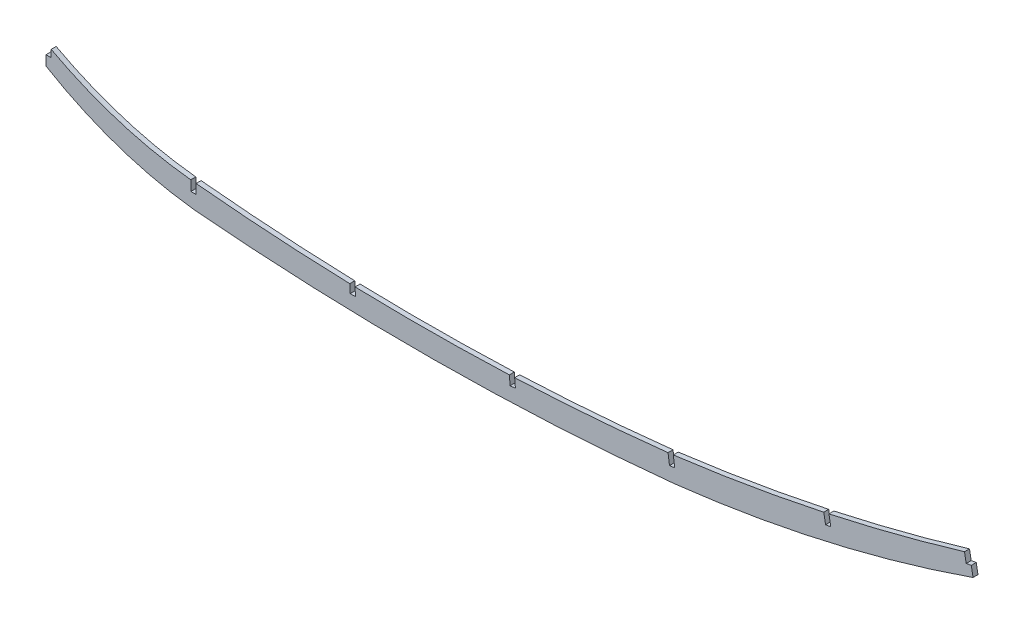
ISO-10303-21;
HEADER;
FILE_DESCRIPTION(('STEP AP214'),'2;1');
FILE_NAME('part.step','',(''),(''),'','','');
FILE_SCHEMA(('AUTOMOTIVE_DESIGN { 1 0 10303 214 1 1 1 1 }'));
ENDSEC;
DATA;
#1=APPLICATION_CONTEXT('core data for automotive mechanical design processes');
#2=APPLICATION_PROTOCOL_DEFINITION('international standard','automotive_design',2000,#1);
#3=PRODUCT_CONTEXT('',#1,'mechanical');
#4=PRODUCT('Part','Part','',(#3));
#5=PRODUCT_RELATED_PRODUCT_CATEGORY('part','',(#4));
#6=PRODUCT_DEFINITION_FORMATION('','',#4);
#7=PRODUCT_DEFINITION_CONTEXT('part definition',#1,'design');
#8=PRODUCT_DEFINITION('design','',#6,#7);
#9=PRODUCT_DEFINITION_SHAPE('','',#8);
#10=(LENGTH_UNIT() NAMED_UNIT(*) SI_UNIT(.MILLI.,.METRE.));
#11=(NAMED_UNIT(*) PLANE_ANGLE_UNIT() SI_UNIT($,.RADIAN.));
#12=(NAMED_UNIT(*) SI_UNIT($,.STERADIAN.) SOLID_ANGLE_UNIT());
#13=UNCERTAINTY_MEASURE_WITH_UNIT(LENGTH_MEASURE(1.E-05),#10,'distance_accuracy_value','');
#14=(GEOMETRIC_REPRESENTATION_CONTEXT(3) GLOBAL_UNCERTAINTY_ASSIGNED_CONTEXT((#13)) GLOBAL_UNIT_ASSIGNED_CONTEXT((#10,
#11,#12)) REPRESENTATION_CONTEXT('',''));
#15=CARTESIAN_POINT('',(0.,0.,0.));
#16=DIRECTION('',(0.,0.,1.));
#17=DIRECTION('',(1.,0.,0.));
#18=AXIS2_PLACEMENT_3D('',#15,#16,#17);
#19=CARTESIAN_POINT('',(254.672451197666,1031.92211819024,-3.175));
#20=DIRECTION('',(0.,0.,1.));
#21=DIRECTION('',(1.,0.,0.));
#22=AXIS2_PLACEMENT_3D('',#19,#20,#21);
#23=CYLINDRICAL_SURFACE('',#22,1150.31332040319);
#24=DIRECTION('',(0.,0.,1.));
#25=VECTOR('',#24,1.);
#26=CARTESIAN_POINT('',(399.839177363026,-109.194596572737,-3.175));
#27=LINE('',#26,#25);
#28=CARTESIAN_POINT('',(399.839177363026,-109.194596572738,0.));
#29=VERTEX_POINT('',#28);
#30=CARTESIAN_POINT('',(399.839177363026,-109.194596572738,-3.175));
#31=VERTEX_POINT('',#30);
#32=EDGE_CURVE('E363',#29,#31,#27,.F.);
#33=ORIENTED_EDGE('',*,*,#32,.F.);
#34=CARTESIAN_POINT('',(254.672451197666,1031.92211819024,0.));
#35=DIRECTION('',(0.,0.,1.));
#36=DIRECTION('',(1.,0.,0.));
#37=AXIS2_PLACEMENT_3D('',#34,#35,#36);
#38=CIRCLE('',#37,1150.31332040319);
#39=CARTESIAN_POINT('',(495.714603883283,-92.8531552425034,0.));
#40=VERTEX_POINT('',#39);
#41=EDGE_CURVE('E406',#29,#40,#38,.T.);
#42=ORIENTED_EDGE('',*,*,#41,.T.);
#43=DIRECTION('',(0.,0.,1.));
#44=VECTOR('',#43,1.);
#45=CARTESIAN_POINT('',(495.714603883283,-92.8531552425034,-3.175));
#46=LINE('',#45,#44);
#47=CARTESIAN_POINT('',(495.714603883283,-92.8531552425034,-3.175));
#48=VERTEX_POINT('',#47);
#49=EDGE_CURVE('E248',#48,#40,#46,.T.);
#50=ORIENTED_EDGE('',*,*,#49,.F.);
#51=CARTESIAN_POINT('',(254.672451197666,1031.92211819024,-3.175));
#52=DIRECTION('',(0.,0.,1.));
#53=DIRECTION('',(1.,0.,0.));
#54=AXIS2_PLACEMENT_3D('',#51,#52,#53);
#55=CIRCLE('',#54,1150.31332040319);
#56=EDGE_CURVE('E381',#31,#48,#55,.T.);
#57=ORIENTED_EDGE('',*,*,#56,.F.);
#58=EDGE_LOOP('',(#33,#42,#50,#57));
#59=FACE_BOUND('',#58,.T.);
#60=ADVANCED_FACE('F38',(#59),#23,.F.);
#61=DIRECTION('',(0.,0.,1.));
#62=VECTOR('',#61,1.);
#63=CARTESIAN_POINT('',(585.429283383532,-69.8131735470222,-3.175));
#64=LINE('',#63,#62);
#65=CARTESIAN_POINT('',(585.429283383532,-69.8131735470223,-3.175));
#66=VERTEX_POINT('',#65);
#67=CARTESIAN_POINT('',(585.429283383532,-69.8131735470222,0.));
#68=VERTEX_POINT('',#67);
#69=EDGE_CURVE('E356',#66,#68,#64,.T.);
#70=ORIENTED_EDGE('',*,*,#69,.F.);
#71=CARTESIAN_POINT('',(499.018474642178,-92.1400490958373,-3.175));
#72=VERTEX_POINT('',#71);
#73=EDGE_CURVE('E378',#72,#66,#55,.T.);
#74=ORIENTED_EDGE('',*,*,#73,.F.);
#75=DIRECTION('',(0.,0.,1.));
#76=VECTOR('',#75,1.);
#77=CARTESIAN_POINT('',(499.018474642178,-92.1400490958373,-3.175));
#78=LINE('',#77,#76);
#79=CARTESIAN_POINT('',(499.018474642178,-92.1400490958373,0.));
#80=VERTEX_POINT('',#79);
#81=EDGE_CURVE('E354',#80,#72,#78,.F.);
#82=ORIENTED_EDGE('',*,*,#81,.F.);
#83=EDGE_CURVE('E377',#80,#68,#38,.T.);
#84=ORIENTED_EDGE('',*,*,#83,.T.);
#85=EDGE_LOOP('',(#70,#74,#82,#84));
#86=FACE_BOUND('',#85,.T.);
#87=ADVANCED_FACE('F531',(#86),#23,.F.);
#88=CARTESIAN_POINT('',(557.656434856401,101.355592915415,-3.175));
#89=DIRECTION('',(0.983881237780973,0.178823124742247,0.));
#90=DIRECTION('',(-0.178823124742247,0.983881237780973,0.));
#91=AXIS2_PLACEMENT_3D('',#88,#89,#90);
#92=PLANE('',#91);
#93=DIRECTION('',(-0.178823124742247,0.983881237780973,0.));
#94=VECTOR('',#93,1.);
#95=CARTESIAN_POINT('',(557.656434856401,101.355592915415,-3.175));
#96=LINE('',#95,#94);
#97=CARTESIAN_POINT('',(590.864339182333,-81.3536291687202,-3.175));
#98=VERTEX_POINT('',#97);
#99=CARTESIAN_POINT('',(589.742350018123,-75.1804673405136,-3.175));
#100=VERTEX_POINT('',#99);
#101=EDGE_CURVE('E400',#98,#100,#96,.T.);
#102=ORIENTED_EDGE('',*,*,#101,.T.);
#103=DIRECTION('',(0.,0.,1.));
#104=VECTOR('',#103,1.);
#105=CARTESIAN_POINT('',(589.742350018123,-75.1804673405136,-3.175));
#106=LINE('',#105,#104);
#107=CARTESIAN_POINT('',(589.742350018123,-75.1804673405136,0.));
#108=VERTEX_POINT('',#107);
#109=EDGE_CURVE('E358',#100,#108,#106,.T.);
#110=ORIENTED_EDGE('',*,*,#109,.T.);
#111=DIRECTION('',(-0.178823124742247,0.983881237780973,0.));
#112=VECTOR('',#111,1.);
#113=CARTESIAN_POINT('',(557.656434856401,101.355592915415,0.));
#114=LINE('',#113,#112);
#115=CARTESIAN_POINT('',(590.864339182333,-81.3536291687202,0.));
#116=VERTEX_POINT('',#115);
#117=EDGE_CURVE('E382',#116,#108,#114,.T.);
#118=ORIENTED_EDGE('',*,*,#117,.F.);
#119=DIRECTION('',(0.,0.,1.));
#120=VECTOR('',#119,1.);
#121=CARTESIAN_POINT('',(590.864339182333,-81.3536291687202,-3.175));
#122=LINE('',#121,#120);
#123=EDGE_CURVE('E429',#98,#116,#122,.T.);
#124=ORIENTED_EDGE('',*,*,#123,.F.);
#125=EDGE_LOOP('',(#102,#110,#118,#124));
#126=FACE_BOUND('',#125,.T.);
#127=ADVANCED_FACE('F541',(#126),#92,.T.);
#128=CARTESIAN_POINT('',(0.,0.,-3.175));
#129=DIRECTION('',(1.,0.,0.));
#130=DIRECTION('',(0.,0.,-1.));
#131=AXIS2_PLACEMENT_3D('',#128,#129,#130);
#132=PLANE('',#131);
#133=DIRECTION('',(0.,0.,1.));
#134=VECTOR('',#133,1.);
#135=CARTESIAN_POINT('',(0.,-88.1812715032451,-3.175));
#136=LINE('',#135,#134);
#137=CARTESIAN_POINT('',(0.,-88.1812715032451,-3.175));
#138=VERTEX_POINT('',#137);
#139=CARTESIAN_POINT('',(0.,-88.1812715032451,0.));
#140=VERTEX_POINT('',#139);
#141=EDGE_CURVE('E249',#138,#140,#136,.T.);
#142=ORIENTED_EDGE('',*,*,#141,.F.);
#143=DIRECTION('',(0.,1.,0.));
#144=VECTOR('',#143,1.);
#145=CARTESIAN_POINT('',(0.,0.,-3.175));
#146=LINE('',#145,#144);
#147=CARTESIAN_POINT('',(0.,-94.4694470237963,-3.175));
#148=VERTEX_POINT('',#147);
#149=EDGE_CURVE('E255',#148,#138,#146,.T.);
#150=ORIENTED_EDGE('',*,*,#149,.F.);
#151=DIRECTION('',(0.,0.,1.));
#152=VECTOR('',#151,1.);
#153=CARTESIAN_POINT('',(0.,-94.4694470237963,-3.175));
#154=LINE('',#153,#152);
#155=CARTESIAN_POINT('',(0.,-94.4694470237963,0.));
#156=VERTEX_POINT('',#155);
#157=EDGE_CURVE('E403',#148,#156,#154,.T.);
#158=ORIENTED_EDGE('',*,*,#157,.T.);
#159=DIRECTION('',(0.,1.,0.));
#160=VECTOR('',#159,1.);
#161=CARTESIAN_POINT('',(0.,0.,0.));
#162=LINE('',#161,#160);
#163=EDGE_CURVE('E415',#156,#140,#162,.T.);
#164=ORIENTED_EDGE('',*,*,#163,.T.);
#165=EDGE_LOOP('',(#142,#150,#158,#164));
#166=FACE_BOUND('',#165,.T.);
#167=ADVANCED_FACE('F555',(#166),#132,.F.);
#168=CARTESIAN_POINT('',(118.154365108344,130.291543645457,-3.175));
#169=DIRECTION('',(0.,0.,1.));
#170=DIRECTION('',(1.,0.,0.));
#171=AXIS2_PLACEMENT_3D('',#168,#169,#170);
#172=CYLINDRICAL_SURFACE('',#171,242.755675026931);
#173=DIRECTION('',(0.,0.,1.));
#174=VECTOR('',#173,1.);
#175=CARTESIAN_POINT('',(3.30200000000001,-83.5758264389031,-3.175));
#176=LINE('',#175,#174);
#177=CARTESIAN_POINT('',(3.30200000000001,-83.5758264389031,0.));
#178=VERTEX_POINT('',#177);
#179=CARTESIAN_POINT('',(3.30200000000001,-83.5758264389031,-3.175));
#180=VERTEX_POINT('',#179);
#181=EDGE_CURVE('E236',#178,#180,#176,.F.);
#182=ORIENTED_EDGE('',*,*,#181,.F.);
#183=CARTESIAN_POINT('',(118.154365108344,130.291543645457,0.));
#184=DIRECTION('',(0.,0.,1.));
#185=DIRECTION('',(1.,0.,0.));
#186=AXIS2_PLACEMENT_3D('',#183,#184,#185);
#187=CIRCLE('',#186,242.755675026931);
#188=CARTESIAN_POINT('',(92.2909,-111.082437823902,0.));
#189=VERTEX_POINT('',#188);
#190=EDGE_CURVE('E412',#178,#189,#187,.T.);
#191=ORIENTED_EDGE('',*,*,#190,.T.);
#192=DIRECTION('',(0.,0.,1.));
#193=VECTOR('',#192,1.);
#194=CARTESIAN_POINT('',(92.2909,-111.082437823902,-3.175));
#195=LINE('',#194,#193);
#196=CARTESIAN_POINT('',(92.2909,-111.082437823902,-3.175));
#197=VERTEX_POINT('',#196);
#198=EDGE_CURVE('E60',#197,#189,#195,.T.);
#199=ORIENTED_EDGE('',*,*,#198,.F.);
#200=CARTESIAN_POINT('',(118.154365108344,130.291543645457,-3.175));
#201=DIRECTION('',(0.,0.,1.));
#202=DIRECTION('',(1.,0.,0.));
#203=AXIS2_PLACEMENT_3D('',#200,#201,#202);
#204=CIRCLE('',#203,242.755675026931);
#205=EDGE_CURVE('E388',#180,#197,#204,.T.);
#206=ORIENTED_EDGE('',*,*,#205,.F.);
#207=EDGE_LOOP('',(#182,#191,#199,#206));
#208=FACE_BOUND('',#207,.T.);
#209=ADVANCED_FACE('F558',(#208),#172,.F.);
#210=CARTESIAN_POINT('',(237.35862434664,1321.37429175112,-3.175));
#211=DIRECTION('',(0.,0.,1.));
#212=DIRECTION('',(1.,0.,0.));
#213=AXIS2_PLACEMENT_3D('',#210,#211,#212);
#214=CYLINDRICAL_SURFACE('',#213,1439.78857693711);
#215=DIRECTION('',(0.,0.,1.));
#216=VECTOR('',#215,1.);
#217=CARTESIAN_POINT('',(95.6691,-111.425493623303,-3.175));
#218=LINE('',#217,#216);
#219=CARTESIAN_POINT('',(95.6691,-111.425493623303,0.));
#220=VERTEX_POINT('',#219);
#221=CARTESIAN_POINT('',(95.6691,-111.425493623303,-3.175));
#222=VERTEX_POINT('',#221);
#223=EDGE_CURVE('E374',#220,#222,#218,.F.);
#224=ORIENTED_EDGE('',*,*,#223,.F.);
#225=CARTESIAN_POINT('',(237.35862434664,1321.37429175112,0.));
#226=DIRECTION('',(0.,0.,1.));
#227=DIRECTION('',(1.,0.,0.));
#228=AXIS2_PLACEMENT_3D('',#225,#226,#227);
#229=CIRCLE('',#228,1439.78857693711);
#230=CARTESIAN_POINT('',(193.623485077633,-117.749880748144,0.));
#231=VERTEX_POINT('',#230);
#232=EDGE_CURVE('E411',#220,#231,#229,.T.);
#233=ORIENTED_EDGE('',*,*,#232,.T.);
#234=DIRECTION('',(0.,0.,1.));
#235=VECTOR('',#234,1.);
#236=CARTESIAN_POINT('',(193.623485077633,-117.749880748144,-3.175));
#237=LINE('',#236,#235);
#238=CARTESIAN_POINT('',(193.623485077633,-117.749880748144,-3.175));
#239=VERTEX_POINT('',#238);
#240=EDGE_CURVE('E369',#239,#231,#237,.T.);
#241=ORIENTED_EDGE('',*,*,#240,.F.);
#242=CARTESIAN_POINT('',(237.35862434664,1321.37429175112,-3.175));
#243=DIRECTION('',(0.,0.,1.));
#244=DIRECTION('',(1.,0.,0.));
#245=AXIS2_PLACEMENT_3D('',#242,#243,#244);
#246=CIRCLE('',#245,1439.78857693711);
#247=EDGE_CURVE('E387',#222,#239,#246,.T.);
#248=ORIENTED_EDGE('',*,*,#247,.F.);
#249=EDGE_LOOP('',(#224,#233,#241,#248));
#250=FACE_BOUND('',#249,.T.);
#251=ADVANCED_FACE('F462',(#250),#214,.F.);
#252=DIRECTION('',(0.,0.,1.));
#253=VECTOR('',#252,1.);
#254=CARTESIAN_POINT('',(197.008785596879,-117.848775320638,-3.175));
#255=LINE('',#254,#253);
#256=CARTESIAN_POINT('',(197.008785596879,-117.848775320638,0.));
#257=VERTEX_POINT('',#256);
#258=CARTESIAN_POINT('',(197.008785596879,-117.848775320638,-3.175));
#259=VERTEX_POINT('',#258);
#260=EDGE_CURVE('E371',#257,#259,#255,.F.);
#261=ORIENTED_EDGE('',*,*,#260,.F.);
#262=CARTESIAN_POINT('',(295.327290668786,-117.24684670174,0.));
#263=VERTEX_POINT('',#262);
#264=EDGE_CURVE('E410',#257,#263,#229,.T.);
#265=ORIENTED_EDGE('',*,*,#264,.T.);
#266=DIRECTION('',(0.,0.,1.));
#267=VECTOR('',#266,1.);
#268=CARTESIAN_POINT('',(295.327290668786,-117.24684670174,-3.175));
#269=LINE('',#268,#267);
#270=CARTESIAN_POINT('',(295.327290668786,-117.24684670174,-3.175));
#271=VERTEX_POINT('',#270);
#272=EDGE_CURVE('E365',#271,#263,#269,.T.);
#273=ORIENTED_EDGE('',*,*,#272,.F.);
#274=EDGE_CURVE('E386',#259,#271,#246,.T.);
#275=ORIENTED_EDGE('',*,*,#274,.F.);
#276=EDGE_LOOP('',(#261,#265,#273,#275));
#277=FACE_BOUND('',#276,.T.);
#278=ADVANCED_FACE('F475',(#277),#214,.F.);
#279=DIRECTION('',(0.,0.,1.));
#280=VECTOR('',#279,1.);
#281=CARTESIAN_POINT('',(298.705922287425,-117.106731868565,-3.175));
#282=LINE('',#281,#280);
#283=CARTESIAN_POINT('',(298.705922287425,-117.106731868565,0.));
#284=VERTEX_POINT('',#283);
#285=CARTESIAN_POINT('',(298.705922287425,-117.106731868565,-3.175));
#286=VERTEX_POINT('',#285);
#287=EDGE_CURVE('E367',#284,#286,#282,.F.);
#288=ORIENTED_EDGE('',*,*,#287,.F.);
#289=CARTESIAN_POINT('',(396.484353389184,-109.593963883941,0.));
#290=VERTEX_POINT('',#289);
#291=EDGE_CURVE('E407',#284,#290,#229,.T.);
#292=ORIENTED_EDGE('',*,*,#291,.T.);
#293=DIRECTION('',(0.,0.,1.));
#294=VECTOR('',#293,1.);
#295=CARTESIAN_POINT('',(396.484353389184,-109.593963883941,-3.175));
#296=LINE('',#295,#294);
#297=CARTESIAN_POINT('',(396.484353389184,-109.593963883941,-3.175));
#298=VERTEX_POINT('',#297);
#299=EDGE_CURVE('E361',#298,#290,#296,.T.);
#300=ORIENTED_EDGE('',*,*,#299,.F.);
#301=EDGE_CURVE('E383',#286,#298,#246,.T.);
#302=ORIENTED_EDGE('',*,*,#301,.F.);
#303=EDGE_LOOP('',(#288,#292,#300,#302));
#304=FACE_BOUND('',#303,.T.);
#305=ADVANCED_FACE('F494',(#304),#214,.F.);
#306=CARTESIAN_POINT('',(0.,0.,-3.175));
#307=DIRECTION('',(0.,0.,1.));
#308=DIRECTION('',(1.,0.,0.));
#309=AXIS2_PLACEMENT_3D('',#306,#307,#308);
#310=PLANE('',#309);
#311=DIRECTION('',(-1.,0.,0.));
#312=VECTOR('',#311,1.);
#313=CARTESIAN_POINT('',(0.,-88.1812715032451,-3.175));
#314=LINE('',#313,#312);
#315=CARTESIAN_POINT('',(3.30200000000001,-88.1812715032451,-3.175));
#316=VERTEX_POINT('',#315);
#317=EDGE_CURVE('E241',#316,#138,#314,.T.);
#318=ORIENTED_EDGE('',*,*,#317,.F.);
#319=DIRECTION('',(0.,-1.,0.));
#320=VECTOR('',#319,1.);
#321=CARTESIAN_POINT('',(3.302,0.,-3.175));
#322=LINE('',#321,#320);
#323=EDGE_CURVE('E233',#180,#316,#322,.T.);
#324=ORIENTED_EDGE('',*,*,#323,.F.);
#325=ORIENTED_EDGE('',*,*,#205,.T.);
#326=DIRECTION('',(0.,1.,0.));
#327=VECTOR('',#326,1.);
#328=CARTESIAN_POINT('',(92.2909,0.,-3.175));
#329=LINE('',#328,#327);
#330=CARTESIAN_POINT('',(92.2909,-117.531253116271,-3.175));
#331=VERTEX_POINT('',#330);
#332=EDGE_CURVE('E267',#331,#197,#329,.T.);
#333=ORIENTED_EDGE('',*,*,#332,.F.);
#334=DIRECTION('',(-1.,0.,0.));
#335=VECTOR('',#334,1.);
#336=CARTESIAN_POINT('',(0.,-117.531253116271,-3.175));
#337=LINE('',#336,#335);
#338=CARTESIAN_POINT('',(95.6691,-117.531253116271,-3.175));
#339=VERTEX_POINT('',#338);
#340=EDGE_CURVE('E274',#339,#331,#337,.T.);
#341=ORIENTED_EDGE('',*,*,#340,.F.);
#342=DIRECTION('',(0.,-1.,0.));
#343=VECTOR('',#342,1.);
#344=CARTESIAN_POINT('',(95.6691,0.,-3.175));
#345=LINE('',#344,#343);
#346=EDGE_CURVE('E270',#222,#339,#345,.T.);
#347=ORIENTED_EDGE('',*,*,#346,.F.);
#348=ORIENTED_EDGE('',*,*,#247,.T.);
#349=DIRECTION('',(-0.0418331153502455,0.99912461207804,0.));
#350=VECTOR('',#349,1.);
#351=CARTESIAN_POINT('',(188.363109812427,7.88671963963063,-3.175));
#352=LINE('',#351,#350);
#353=CARTESIAN_POINT('',(193.849633474482,-123.151114373269,-3.175));
#354=VERTEX_POINT('',#353);
#355=EDGE_CURVE('E283',#354,#239,#352,.T.);
#356=ORIENTED_EDGE('',*,*,#355,.F.);
#357=DIRECTION('',(-0.99912461207804,-0.0418331153502432,0.));
#358=VECTOR('',#357,1.);
#359=CARTESIAN_POINT('',(5.48652366205496,-131.037834012899,-3.175));
#360=LINE('',#359,#358);
#361=CARTESIAN_POINT('',(197.224876239004,-123.009793742993,-3.175));
#362=VERTEX_POINT('',#361);
#363=EDGE_CURVE('E291',#362,#354,#360,.T.);
#364=ORIENTED_EDGE('',*,*,#363,.F.);
#365=DIRECTION('',(0.0418331153502416,-0.99912461207804,0.));
#366=VECTOR('',#365,1.);
#367=CARTESIAN_POINT('',(191.738352576949,8.0280402699061,-3.175));
#368=LINE('',#367,#366);
#369=EDGE_CURVE('E287',#259,#362,#368,.T.);
#370=ORIENTED_EDGE('',*,*,#369,.F.);
#371=ORIENTED_EDGE('',*,*,#274,.T.);
#372=DIRECTION('',(-0.085762623036021,0.996315598839033,0.));
#373=VECTOR('',#372,1.);
#374=CARTESIAN_POINT('',(283.136742256964,24.3723471981433,-3.175));
#375=LINE('',#374,#373);
#376=CARTESIAN_POINT('',(295.823280702412,-123.008827735861,-3.175));
#377=VERTEX_POINT('',#376);
#378=EDGE_CURVE('E300',#377,#271,#375,.T.);
#379=ORIENTED_EDGE('',*,*,#378,.F.);
#380=DIRECTION('',(-0.996315598839033,-0.0857626230360193,0.));
#381=VECTOR('',#380,1.);
#382=CARTESIAN_POINT('',(12.6865384454476,-147.381174934004,-3.175));
#383=LINE('',#382,#381);
#384=CARTESIAN_POINT('',(299.18903405841,-122.719104442721,-3.175));
#385=VERTEX_POINT('',#384);
#386=EDGE_CURVE('E308',#385,#377,#383,.T.);
#387=ORIENTED_EDGE('',*,*,#386,.F.);
#388=DIRECTION('',(0.0857626230360208,-0.996315598839033,0.));
#389=VECTOR('',#388,1.);
#390=CARTESIAN_POINT('',(286.502495612962,24.6620704912836,-3.175));
#391=LINE('',#390,#389);
#392=EDGE_CURVE('E304',#286,#385,#391,.T.);
#393=ORIENTED_EDGE('',*,*,#392,.F.);
#394=ORIENTED_EDGE('',*,*,#301,.T.);
#395=DIRECTION('',(-0.13167529013522,0.991292902207922,0.));
#396=VECTOR('',#395,1.);
#397=CARTESIAN_POINT('',(375.304789743613,49.8524371238385,-3.175));
#398=LINE('',#397,#396);
#399=CARTESIAN_POINT('',(397.375099539173,-116.29978040613,-3.175));
#400=VERTEX_POINT('',#399);
#401=EDGE_CURVE('E317',#400,#298,#398,.T.);
#402=ORIENTED_EDGE('',*,*,#401,.F.);
#403=DIRECTION('',(-0.991292902207923,-0.131675290135217,0.));
#404=VECTOR('',#403,1.);
#405=CARTESIAN_POINT('',(22.0703097955596,-166.152217529968,-3.175));
#406=LINE('',#405,#404);
#407=CARTESIAN_POINT('',(400.723885221412,-115.854954940995,-3.175));
#408=VERTEX_POINT('',#407);
#409=EDGE_CURVE('E325',#408,#400,#406,.T.);
#410=ORIENTED_EDGE('',*,*,#409,.F.);
#411=DIRECTION('',(0.131675290135219,-0.991292902207923,0.));
#412=VECTOR('',#411,1.);
#413=CARTESIAN_POINT('',(378.653575425851,50.2972625889732,-3.175));
#414=LINE('',#413,#412);
#415=EDGE_CURVE('E321',#31,#408,#414,.T.);
#416=ORIENTED_EDGE('',*,*,#415,.F.);
#417=ORIENTED_EDGE('',*,*,#56,.T.);
#418=DIRECTION('',(-0.179393575490301,0.983777385932816,0.));
#419=VECTOR('',#418,1.);
#420=CARTESIAN_POINT('',(463.374454050911,84.4971650006354,-3.175));
#421=LINE('',#420,#419);
#422=CARTESIAN_POINT('',(496.875793956633,-99.2210116822308,-3.175));
#423=VERTEX_POINT('',#422);
#424=EDGE_CURVE('E342',#423,#48,#421,.T.);
#425=ORIENTED_EDGE('',*,*,#424,.F.);
#426=DIRECTION('',(-0.983777385932816,-0.179393575490302,0.));
#427=VECTOR('',#426,1.);
#428=CARTESIAN_POINT('',(33.5013399057226,-183.718176682867,-3.175));
#429=LINE('',#428,#427);
#430=CARTESIAN_POINT('',(500.199190721791,-98.6149843055094,-3.175));
#431=VERTEX_POINT('',#430);
#432=EDGE_CURVE('E350',#431,#423,#429,.T.);
#433=ORIENTED_EDGE('',*,*,#432,.F.);
#434=DIRECTION('',(0.179393575490294,-0.983777385932818,0.));
#435=VECTOR('',#434,1.);
#436=CARTESIAN_POINT('',(466.697850816071,85.1031923773537,-3.175));
#437=LINE('',#436,#435);
#438=EDGE_CURVE('E346',#72,#431,#437,.T.);
#439=ORIENTED_EDGE('',*,*,#438,.F.);
#440=ORIENTED_EDGE('',*,*,#73,.T.);
#441=DIRECTION('',(-0.179393575515032,0.983777385928307,0.));
#442=VECTOR('',#441,1.);
#443=CARTESIAN_POINT('',(554.268103787365,101.071785502089,-3.175));
#444=LINE('',#443,#442);
#445=CARTESIAN_POINT('',(586.515324681227,-75.7689212140668,-3.175));
#446=VERTEX_POINT('',#445);
#447=EDGE_CURVE('E330',#446,#66,#444,.T.);
#448=ORIENTED_EDGE('',*,*,#447,.F.);
#449=DIRECTION('',(-0.983777385928307,-0.179393575515032,0.));
#450=VECTOR('',#449,1.);
#451=CARTESIAN_POINT('',(32.2472208938621,-176.840706716156,-3.175));
#452=LINE('',#451,#450);
#453=EDGE_CURVE('E334',#100,#446,#452,.T.);
#454=ORIENTED_EDGE('',*,*,#453,.F.);
#455=ORIENTED_EDGE('',*,*,#101,.F.);
#456=CARTESIAN_POINT('',(300.498350227972,753.512922358262,-3.175));
#457=DIRECTION('',(0.,0.,1.));
#458=DIRECTION('',(1.,0.,0.));
#459=AXIS2_PLACEMENT_3D('',#456,#457,#458);
#460=CIRCLE('',#459,883.92);
#461=CARTESIAN_POINT('',(400.203586986722,-124.765753326672,-3.175));
#462=VERTEX_POINT('',#461);
#463=EDGE_CURVE('E397',#462,#98,#460,.T.);
#464=ORIENTED_EDGE('',*,*,#463,.F.);
#465=CARTESIAN_POINT('',(237.971630213688,1487.12434573409,-3.175));
#466=DIRECTION('',(0.,0.,1.));
#467=DIRECTION('',(1.,0.,0.));
#468=AXIS2_PLACEMENT_3D('',#465,#466,#467);
#469=CIRCLE('',#468,1620.03361053051);
#470=CARTESIAN_POINT('',(93.9800000000004,-126.497453101351,-3.175));
#471=VERTEX_POINT('',#470);
#472=EDGE_CURVE('E394',#471,#462,#469,.T.);
#473=ORIENTED_EDGE('',*,*,#472,.F.);
#474=CARTESIAN_POINT('',(121.734926149577,108.841104283008,-3.175));
#475=DIRECTION('',(0.,0.,1.));
#476=DIRECTION('',(1.,0.,0.));
#477=AXIS2_PLACEMENT_3D('',#474,#475,#476);
#478=CIRCLE('',#477,236.969560318028);
#479=EDGE_CURVE('E391',#148,#471,#478,.T.);
#480=ORIENTED_EDGE('',*,*,#479,.F.);
#481=ORIENTED_EDGE('',*,*,#149,.T.);
#482=EDGE_LOOP('',(#318,#324,#325,#333,#341,#347,#348,#356,#364,#370,#371,#379,#387,#393,#394,
#402,#410,#416,#417,#425,#433,#439,#440,#448,#454,#455,#464,#473,#480,#481));
#483=FACE_BOUND('',#482,.T.);
#484=ADVANCED_FACE('F252',(#483),#310,.F.);
#485=CARTESIAN_POINT('',(0.,0.,0.));
#486=DIRECTION('',(0.,0.,1.));
#487=DIRECTION('',(1.,0.,0.));
#488=AXIS2_PLACEMENT_3D('',#485,#486,#487);
#489=PLANE('',#488);
#490=DIRECTION('',(0.,-1.,0.));
#491=VECTOR('',#490,1.);
#492=CARTESIAN_POINT('',(3.30200000000001,0.,0.));
#493=LINE('',#492,#491);
#494=CARTESIAN_POINT('',(3.30200000000001,-88.1812715032451,0.));
#495=VERTEX_POINT('',#494);
#496=EDGE_CURVE('E11',#178,#495,#493,.T.);
#497=ORIENTED_EDGE('',*,*,#496,.T.);
#498=DIRECTION('',(-1.,0.,0.));
#499=VECTOR('',#498,1.);
#500=CARTESIAN_POINT('',(0.,-88.1812715032451,0.));
#501=LINE('',#500,#499);
#502=EDGE_CURVE('E242',#495,#140,#501,.T.);
#503=ORIENTED_EDGE('',*,*,#502,.T.);
#504=ORIENTED_EDGE('',*,*,#163,.F.);
#505=CARTESIAN_POINT('',(121.734926149577,108.841104283008,0.));
#506=DIRECTION('',(0.,0.,1.));
#507=DIRECTION('',(1.,0.,0.));
#508=AXIS2_PLACEMENT_3D('',#505,#506,#507);
#509=CIRCLE('',#508,236.969560318028);
#510=CARTESIAN_POINT('',(93.9800000000004,-126.497453101351,0.));
#511=VERTEX_POINT('',#510);
#512=EDGE_CURVE('E418',#156,#511,#509,.T.);
#513=ORIENTED_EDGE('',*,*,#512,.T.);
#514=CARTESIAN_POINT('',(237.971630213688,1487.12434573409,0.));
#515=DIRECTION('',(0.,0.,1.));
#516=DIRECTION('',(1.,0.,0.));
#517=AXIS2_PLACEMENT_3D('',#514,#515,#516);
#518=CIRCLE('',#517,1620.03361053051);
#519=CARTESIAN_POINT('',(400.203586986722,-124.765753326672,0.));
#520=VERTEX_POINT('',#519);
#521=EDGE_CURVE('E421',#511,#520,#518,.T.);
#522=ORIENTED_EDGE('',*,*,#521,.T.);
#523=CARTESIAN_POINT('',(300.498350227972,753.512922358262,0.));
#524=DIRECTION('',(0.,0.,1.));
#525=DIRECTION('',(1.,0.,0.));
#526=AXIS2_PLACEMENT_3D('',#523,#524,#525);
#527=CIRCLE('',#526,883.92);
#528=EDGE_CURVE('E424',#520,#116,#527,.T.);
#529=ORIENTED_EDGE('',*,*,#528,.T.);
#530=ORIENTED_EDGE('',*,*,#117,.T.);
#531=DIRECTION('',(-0.983777385928307,-0.179393575515032,0.));
#532=VECTOR('',#531,1.);
#533=CARTESIAN_POINT('',(32.2472208938621,-176.840706716156,0.));
#534=LINE('',#533,#532);
#535=CARTESIAN_POINT('',(586.515324681227,-75.7689212140668,0.));
#536=VERTEX_POINT('',#535);
#537=EDGE_CURVE('E439',#108,#536,#534,.T.);
#538=ORIENTED_EDGE('',*,*,#537,.T.);
#539=DIRECTION('',(-0.179393575515032,0.983777385928307,0.));
#540=VECTOR('',#539,1.);
#541=CARTESIAN_POINT('',(554.268103787365,101.071785502089,0.));
#542=LINE('',#541,#540);
#543=EDGE_CURVE('E315',#536,#68,#542,.T.);
#544=ORIENTED_EDGE('',*,*,#543,.T.);
#545=ORIENTED_EDGE('',*,*,#83,.F.);
#546=DIRECTION('',(0.179393575490294,-0.983777385932818,0.));
#547=VECTOR('',#546,1.);
#548=CARTESIAN_POINT('',(466.697850816071,85.1031923773537,0.));
#549=LINE('',#548,#547);
#550=CARTESIAN_POINT('',(500.199190721791,-98.6149843055094,0.));
#551=VERTEX_POINT('',#550);
#552=EDGE_CURVE('E431',#80,#551,#549,.T.);
#553=ORIENTED_EDGE('',*,*,#552,.T.);
#554=DIRECTION('',(-0.983777385932816,-0.179393575490302,0.));
#555=VECTOR('',#554,1.);
#556=CARTESIAN_POINT('',(33.5013399057226,-183.718176682867,0.));
#557=LINE('',#556,#555);
#558=CARTESIAN_POINT('',(496.875793956633,-99.2210116822308,0.));
#559=VERTEX_POINT('',#558);
#560=EDGE_CURVE('E331',#551,#559,#557,.T.);
#561=ORIENTED_EDGE('',*,*,#560,.T.);
#562=DIRECTION('',(-0.179393575490301,0.983777385932816,0.));
#563=VECTOR('',#562,1.);
#564=CARTESIAN_POINT('',(463.374454050911,84.4971650006354,0.));
#565=LINE('',#564,#563);
#566=EDGE_CURVE('E343',#559,#40,#565,.T.);
#567=ORIENTED_EDGE('',*,*,#566,.T.);
#568=ORIENTED_EDGE('',*,*,#41,.F.);
#569=DIRECTION('',(0.131675290135219,-0.991292902207923,0.));
#570=VECTOR('',#569,1.);
#571=CARTESIAN_POINT('',(378.653575425851,50.2972625889732,0.));
#572=LINE('',#571,#570);
#573=CARTESIAN_POINT('',(400.723885221412,-115.854954940995,0.));
#574=VERTEX_POINT('',#573);
#575=EDGE_CURVE('E442',#29,#574,#572,.T.);
#576=ORIENTED_EDGE('',*,*,#575,.T.);
#577=DIRECTION('',(-0.991292902207923,-0.131675290135217,0.));
#578=VECTOR('',#577,1.);
#579=CARTESIAN_POINT('',(22.0703097955596,-166.152217529968,0.));
#580=LINE('',#579,#578);
#581=CARTESIAN_POINT('',(397.375099539173,-116.29978040613,0.));
#582=VERTEX_POINT('',#581);
#583=EDGE_CURVE('E298',#574,#582,#580,.T.);
#584=ORIENTED_EDGE('',*,*,#583,.T.);
#585=DIRECTION('',(-0.13167529013522,0.991292902207922,0.));
#586=VECTOR('',#585,1.);
#587=CARTESIAN_POINT('',(375.304789743613,49.8524371238385,0.));
#588=LINE('',#587,#586);
#589=EDGE_CURVE('E318',#582,#290,#588,.T.);
#590=ORIENTED_EDGE('',*,*,#589,.T.);
#591=ORIENTED_EDGE('',*,*,#291,.F.);
#592=DIRECTION('',(0.0857626230360208,-0.996315598839033,0.));
#593=VECTOR('',#592,1.);
#594=CARTESIAN_POINT('',(286.502495612962,24.6620704912836,0.));
#595=LINE('',#594,#593);
#596=CARTESIAN_POINT('',(299.18903405841,-122.719104442721,0.));
#597=VERTEX_POINT('',#596);
#598=EDGE_CURVE('E445',#284,#597,#595,.T.);
#599=ORIENTED_EDGE('',*,*,#598,.T.);
#600=DIRECTION('',(-0.996315598839033,-0.0857626230360193,0.));
#601=VECTOR('',#600,1.);
#602=CARTESIAN_POINT('',(12.6865384454476,-147.381174934004,0.));
#603=LINE('',#602,#601);
#604=CARTESIAN_POINT('',(295.823280702412,-123.008827735861,0.));
#605=VERTEX_POINT('',#604);
#606=EDGE_CURVE('E281',#597,#605,#603,.T.);
#607=ORIENTED_EDGE('',*,*,#606,.T.);
#608=DIRECTION('',(-0.085762623036021,0.996315598839033,0.));
#609=VECTOR('',#608,1.);
#610=CARTESIAN_POINT('',(283.136742256964,24.3723471981433,0.));
#611=LINE('',#610,#609);
#612=EDGE_CURVE('E301',#605,#263,#611,.T.);
#613=ORIENTED_EDGE('',*,*,#612,.T.);
#614=ORIENTED_EDGE('',*,*,#264,.F.);
#615=DIRECTION('',(0.0418331153502416,-0.99912461207804,0.));
#616=VECTOR('',#615,1.);
#617=CARTESIAN_POINT('',(191.738352576949,8.0280402699061,0.));
#618=LINE('',#617,#616);
#619=CARTESIAN_POINT('',(197.224876239004,-123.009793742993,0.));
#620=VERTEX_POINT('',#619);
#621=EDGE_CURVE('E448',#257,#620,#618,.T.);
#622=ORIENTED_EDGE('',*,*,#621,.T.);
#623=DIRECTION('',(-0.99912461207804,-0.0418331153502432,0.));
#624=VECTOR('',#623,1.);
#625=CARTESIAN_POINT('',(5.48652366205496,-131.037834012899,0.));
#626=LINE('',#625,#624);
#627=CARTESIAN_POINT('',(193.849633474482,-123.151114373269,0.));
#628=VERTEX_POINT('',#627);
#629=EDGE_CURVE('E265',#620,#628,#626,.T.);
#630=ORIENTED_EDGE('',*,*,#629,.T.);
#631=DIRECTION('',(-0.0418331153502455,0.99912461207804,0.));
#632=VECTOR('',#631,1.);
#633=CARTESIAN_POINT('',(188.363109812427,7.88671963963063,0.));
#634=LINE('',#633,#632);
#635=EDGE_CURVE('E284',#628,#231,#634,.T.);
#636=ORIENTED_EDGE('',*,*,#635,.T.);
#637=ORIENTED_EDGE('',*,*,#232,.F.);
#638=DIRECTION('',(0.,-1.,0.));
#639=VECTOR('',#638,1.);
#640=CARTESIAN_POINT('',(95.6691,0.,0.));
#641=LINE('',#640,#639);
#642=CARTESIAN_POINT('',(95.6691,-117.531253116271,0.));
#643=VERTEX_POINT('',#642);
#644=EDGE_CURVE('E45',#220,#643,#641,.T.);
#645=ORIENTED_EDGE('',*,*,#644,.T.);
#646=DIRECTION('',(-1.,0.,0.));
#647=VECTOR('',#646,1.);
#648=CARTESIAN_POINT('',(0.,-117.531253116271,0.));
#649=LINE('',#648,#647);
#650=CARTESIAN_POINT('',(92.2909,-117.531253116271,0.));
#651=VERTEX_POINT('',#650);
#652=EDGE_CURVE('E259',#643,#651,#649,.T.);
#653=ORIENTED_EDGE('',*,*,#652,.T.);
#654=DIRECTION('',(0.,1.,0.));
#655=VECTOR('',#654,1.);
#656=CARTESIAN_POINT('',(92.2909,0.,0.));
#657=LINE('',#656,#655);
#658=EDGE_CURVE('E268',#651,#189,#657,.T.);
#659=ORIENTED_EDGE('',*,*,#658,.T.);
#660=ORIENTED_EDGE('',*,*,#190,.F.);
#661=EDGE_LOOP('',(#497,#503,#504,#513,#522,#529,#530,#538,#544,#545,#553,#561,#567,#568,#576,
#584,#590,#591,#599,#607,#613,#614,#622,#630,#636,#637,#645,#653,#659,#660));
#662=FACE_BOUND('',#661,.T.);
#663=ADVANCED_FACE('F453',(#662),#489,.T.);
#664=CARTESIAN_POINT('',(300.498350227972,753.512922358262,-3.175));
#665=DIRECTION('',(0.,0.,1.));
#666=DIRECTION('',(1.,0.,0.));
#667=AXIS2_PLACEMENT_3D('',#664,#665,#666);
#668=CYLINDRICAL_SURFACE('',#667,883.92);
#669=ORIENTED_EDGE('',*,*,#528,.F.);
#670=DIRECTION('',(0.,0.,1.));
#671=VECTOR('',#670,1.);
#672=CARTESIAN_POINT('',(400.203586986722,-124.765753326672,-3.175));
#673=LINE('',#672,#671);
#674=EDGE_CURVE('E432',#462,#520,#673,.T.);
#675=ORIENTED_EDGE('',*,*,#674,.F.);
#676=ORIENTED_EDGE('',*,*,#463,.T.);
#677=ORIENTED_EDGE('',*,*,#123,.T.);
#678=EDGE_LOOP('',(#669,#675,#676,#677));
#679=FACE_BOUND('',#678,.T.);
#680=ADVANCED_FACE('F589',(#679),#668,.T.);
#681=CARTESIAN_POINT('',(237.971630213688,1487.12434573409,-3.175));
#682=DIRECTION('',(0.,0.,1.));
#683=DIRECTION('',(1.,0.,0.));
#684=AXIS2_PLACEMENT_3D('',#681,#682,#683);
#685=CYLINDRICAL_SURFACE('',#684,1620.03361053051);
#686=ORIENTED_EDGE('',*,*,#521,.F.);
#687=DIRECTION('',(0.,0.,1.));
#688=VECTOR('',#687,1.);
#689=CARTESIAN_POINT('',(93.9800000000004,-126.497453101351,-3.175));
#690=LINE('',#689,#688);
#691=EDGE_CURVE('E434',#471,#511,#690,.T.);
#692=ORIENTED_EDGE('',*,*,#691,.F.);
#693=ORIENTED_EDGE('',*,*,#472,.T.);
#694=ORIENTED_EDGE('',*,*,#674,.T.);
#695=EDGE_LOOP('',(#686,#692,#693,#694));
#696=FACE_BOUND('',#695,.T.);
#697=ADVANCED_FACE('F548',(#696),#685,.T.);
#698=CARTESIAN_POINT('',(121.734926149577,108.841104283008,-3.175));
#699=DIRECTION('',(0.,0.,1.));
#700=DIRECTION('',(1.,0.,0.));
#701=AXIS2_PLACEMENT_3D('',#698,#699,#700);
#702=CYLINDRICAL_SURFACE('',#701,236.969560318028);
#703=ORIENTED_EDGE('',*,*,#512,.F.);
#704=ORIENTED_EDGE('',*,*,#157,.F.);
#705=ORIENTED_EDGE('',*,*,#479,.T.);
#706=ORIENTED_EDGE('',*,*,#691,.T.);
#707=EDGE_LOOP('',(#703,#704,#705,#706));
#708=FACE_BOUND('',#707,.T.);
#709=ADVANCED_FACE('F552',(#708),#702,.T.);
#710=CARTESIAN_POINT('',(466.697850816071,85.1031923773537,-3.175));
#711=DIRECTION('',(-0.983777385932818,-0.179393575490294,0.));
#712=DIRECTION('',(0.179393575490294,-0.983777385932818,0.));
#713=AXIS2_PLACEMENT_3D('',#710,#711,#712);
#714=PLANE('',#713);
#715=ORIENTED_EDGE('',*,*,#81,.T.);
#716=ORIENTED_EDGE('',*,*,#438,.T.);
#717=DIRECTION('',(0.,0.,1.));
#718=VECTOR('',#717,1.);
#719=CARTESIAN_POINT('',(500.199190721791,-98.6149843055094,-3.175));
#720=LINE('',#719,#718);
#721=EDGE_CURVE('E337',#431,#551,#720,.T.);
#722=ORIENTED_EDGE('',*,*,#721,.T.);
#723=ORIENTED_EDGE('',*,*,#552,.F.);
#724=EDGE_LOOP('',(#715,#716,#722,#723));
#725=FACE_BOUND('',#724,.T.);
#726=ADVANCED_FACE('F524',(#725),#714,.T.);
#727=CARTESIAN_POINT('',(463.374454050911,84.4971650006354,-3.175));
#728=DIRECTION('',(0.983777385932816,0.179393575490301,0.));
#729=DIRECTION('',(-0.179393575490301,0.983777385932816,0.));
#730=AXIS2_PLACEMENT_3D('',#727,#728,#729);
#731=PLANE('',#730);
#732=ORIENTED_EDGE('',*,*,#49,.T.);
#733=ORIENTED_EDGE('',*,*,#566,.F.);
#734=DIRECTION('',(0.,0.,1.));
#735=VECTOR('',#734,1.);
#736=CARTESIAN_POINT('',(496.875793956633,-99.2210116822308,-3.175));
#737=LINE('',#736,#735);
#738=EDGE_CURVE('E340',#423,#559,#737,.T.);
#739=ORIENTED_EDGE('',*,*,#738,.F.);
#740=ORIENTED_EDGE('',*,*,#424,.T.);
#741=EDGE_LOOP('',(#732,#733,#739,#740));
#742=FACE_BOUND('',#741,.T.);
#743=ADVANCED_FACE('F516',(#742),#731,.T.);
#744=CARTESIAN_POINT('',(33.5013399057226,-183.718176682867,-3.175));
#745=DIRECTION('',(-0.179393575490302,0.983777385932816,0.));
#746=DIRECTION('',(-0.983777385932816,-0.179393575490302,0.));
#747=AXIS2_PLACEMENT_3D('',#744,#745,#746);
#748=PLANE('',#747);
#749=ORIENTED_EDGE('',*,*,#560,.F.);
#750=ORIENTED_EDGE('',*,*,#721,.F.);
#751=ORIENTED_EDGE('',*,*,#432,.T.);
#752=ORIENTED_EDGE('',*,*,#738,.T.);
#753=EDGE_LOOP('',(#749,#750,#751,#752));
#754=FACE_BOUND('',#753,.T.);
#755=ADVANCED_FACE('F521',(#754),#748,.T.);
#756=CARTESIAN_POINT('',(554.268103787365,101.071785502089,-3.175));
#757=DIRECTION('',(0.983777385928307,0.179393575515032,0.));
#758=DIRECTION('',(-0.179393575515032,0.983777385928307,0.));
#759=AXIS2_PLACEMENT_3D('',#756,#757,#758);
#760=PLANE('',#759);
#761=ORIENTED_EDGE('',*,*,#69,.T.);
#762=ORIENTED_EDGE('',*,*,#543,.F.);
#763=DIRECTION('',(0.,0.,1.));
#764=VECTOR('',#763,1.);
#765=CARTESIAN_POINT('',(586.515324681227,-75.7689212140668,-3.175));
#766=LINE('',#765,#764);
#767=EDGE_CURVE('E328',#446,#536,#766,.T.);
#768=ORIENTED_EDGE('',*,*,#767,.F.);
#769=ORIENTED_EDGE('',*,*,#447,.T.);
#770=EDGE_LOOP('',(#761,#762,#768,#769));
#771=FACE_BOUND('',#770,.T.);
#772=ADVANCED_FACE('F534',(#771),#760,.T.);
#773=CARTESIAN_POINT('',(32.2472208938621,-176.840706716156,-3.175));
#774=DIRECTION('',(-0.179393575515032,0.983777385928307,0.));
#775=DIRECTION('',(-0.983777385928307,-0.179393575515032,0.));
#776=AXIS2_PLACEMENT_3D('',#773,#774,#775);
#777=PLANE('',#776);
#778=ORIENTED_EDGE('',*,*,#453,.T.);
#779=ORIENTED_EDGE('',*,*,#767,.T.);
#780=ORIENTED_EDGE('',*,*,#537,.F.);
#781=ORIENTED_EDGE('',*,*,#109,.F.);
#782=EDGE_LOOP('',(#778,#779,#780,#781));
#783=FACE_BOUND('',#782,.T.);
#784=ADVANCED_FACE('F538',(#783),#777,.T.);
#785=CARTESIAN_POINT('',(378.653575425851,50.2972625889732,-3.175));
#786=DIRECTION('',(-0.991292902207922,-0.131675290135219,0.));
#787=DIRECTION('',(0.131675290135219,-0.991292902207923,0.));
#788=AXIS2_PLACEMENT_3D('',#785,#786,#787);
#789=PLANE('',#788);
#790=ORIENTED_EDGE('',*,*,#32,.T.);
#791=ORIENTED_EDGE('',*,*,#415,.T.);
#792=DIRECTION('',(0.,0.,1.));
#793=VECTOR('',#792,1.);
#794=CARTESIAN_POINT('',(400.723885221412,-115.854954940995,-3.175));
#795=LINE('',#794,#793);
#796=EDGE_CURVE('E311',#408,#574,#795,.T.);
#797=ORIENTED_EDGE('',*,*,#796,.T.);
#798=ORIENTED_EDGE('',*,*,#575,.F.);
#799=EDGE_LOOP('',(#790,#791,#797,#798));
#800=FACE_BOUND('',#799,.T.);
#801=ADVANCED_FACE('F505',(#800),#789,.T.);
#802=CARTESIAN_POINT('',(375.304789743613,49.8524371238385,-3.175));
#803=DIRECTION('',(0.991292902207923,0.13167529013522,0.));
#804=DIRECTION('',(-0.13167529013522,0.991292902207923,0.));
#805=AXIS2_PLACEMENT_3D('',#802,#803,#804);
#806=PLANE('',#805);
#807=ORIENTED_EDGE('',*,*,#299,.T.);
#808=ORIENTED_EDGE('',*,*,#589,.F.);
#809=DIRECTION('',(0.,0.,1.));
#810=VECTOR('',#809,1.);
#811=CARTESIAN_POINT('',(397.375099539173,-116.29978040613,-3.175));
#812=LINE('',#811,#810);
#813=EDGE_CURVE('E314',#400,#582,#812,.T.);
#814=ORIENTED_EDGE('',*,*,#813,.F.);
#815=ORIENTED_EDGE('',*,*,#401,.T.);
#816=EDGE_LOOP('',(#807,#808,#814,#815));
#817=FACE_BOUND('',#816,.T.);
#818=ADVANCED_FACE('F497',(#817),#806,.T.);
#819=CARTESIAN_POINT('',(22.0703097955596,-166.152217529968,-3.175));
#820=DIRECTION('',(-0.131675290135217,0.991292902207923,0.));
#821=DIRECTION('',(-0.991292902207923,-0.131675290135217,0.));
#822=AXIS2_PLACEMENT_3D('',#819,#820,#821);
#823=PLANE('',#822);
#824=ORIENTED_EDGE('',*,*,#583,.F.);
#825=ORIENTED_EDGE('',*,*,#796,.F.);
#826=ORIENTED_EDGE('',*,*,#409,.T.);
#827=ORIENTED_EDGE('',*,*,#813,.T.);
#828=EDGE_LOOP('',(#824,#825,#826,#827));
#829=FACE_BOUND('',#828,.T.);
#830=ADVANCED_FACE('F502',(#829),#823,.T.);
#831=CARTESIAN_POINT('',(286.502495612962,24.6620704912836,-3.175));
#832=DIRECTION('',(-0.996315598839033,-0.0857626230360208,0.));
#833=DIRECTION('',(0.0857626230360208,-0.996315598839033,0.));
#834=AXIS2_PLACEMENT_3D('',#831,#832,#833);
#835=PLANE('',#834);
#836=ORIENTED_EDGE('',*,*,#287,.T.);
#837=ORIENTED_EDGE('',*,*,#392,.T.);
#838=DIRECTION('',(0.,0.,1.));
#839=VECTOR('',#838,1.);
#840=CARTESIAN_POINT('',(299.18903405841,-122.719104442721,-3.175));
#841=LINE('',#840,#839);
#842=EDGE_CURVE('E294',#385,#597,#841,.T.);
#843=ORIENTED_EDGE('',*,*,#842,.T.);
#844=ORIENTED_EDGE('',*,*,#598,.F.);
#845=EDGE_LOOP('',(#836,#837,#843,#844));
#846=FACE_BOUND('',#845,.T.);
#847=ADVANCED_FACE('F487',(#846),#835,.T.);
#848=CARTESIAN_POINT('',(283.136742256964,24.3723471981433,-3.175));
#849=DIRECTION('',(0.996315598839033,0.085762623036021,0.));
#850=DIRECTION('',(-0.085762623036021,0.996315598839033,0.));
#851=AXIS2_PLACEMENT_3D('',#848,#849,#850);
#852=PLANE('',#851);
#853=ORIENTED_EDGE('',*,*,#272,.T.);
#854=ORIENTED_EDGE('',*,*,#612,.F.);
#855=DIRECTION('',(0.,0.,1.));
#856=VECTOR('',#855,1.);
#857=CARTESIAN_POINT('',(295.823280702412,-123.008827735861,-3.175));
#858=LINE('',#857,#856);
#859=EDGE_CURVE('E297',#377,#605,#858,.T.);
#860=ORIENTED_EDGE('',*,*,#859,.F.);
#861=ORIENTED_EDGE('',*,*,#378,.T.);
#862=EDGE_LOOP('',(#853,#854,#860,#861));
#863=FACE_BOUND('',#862,.T.);
#864=ADVANCED_FACE('F480',(#863),#852,.T.);
#865=CARTESIAN_POINT('',(12.6865384454476,-147.381174934004,-3.175));
#866=DIRECTION('',(-0.0857626230360193,0.996315598839033,0.));
#867=DIRECTION('',(-0.996315598839034,-0.0857626230360193,0.));
#868=AXIS2_PLACEMENT_3D('',#865,#866,#867);
#869=PLANE('',#868);
#870=ORIENTED_EDGE('',*,*,#606,.F.);
#871=ORIENTED_EDGE('',*,*,#842,.F.);
#872=ORIENTED_EDGE('',*,*,#386,.T.);
#873=ORIENTED_EDGE('',*,*,#859,.T.);
#874=EDGE_LOOP('',(#870,#871,#872,#873));
#875=FACE_BOUND('',#874,.T.);
#876=ADVANCED_FACE('F485',(#875),#869,.T.);
#877=CARTESIAN_POINT('',(191.738352576949,8.0280402699061,-3.175));
#878=DIRECTION('',(-0.99912461207804,-0.0418331153502416,0.));
#879=DIRECTION('',(0.0418331153502416,-0.99912461207804,0.));
#880=AXIS2_PLACEMENT_3D('',#877,#878,#879);
#881=PLANE('',#880);
#882=ORIENTED_EDGE('',*,*,#260,.T.);
#883=ORIENTED_EDGE('',*,*,#369,.T.);
#884=DIRECTION('',(0.,0.,1.));
#885=VECTOR('',#884,1.);
#886=CARTESIAN_POINT('',(197.224876239004,-123.009793742993,-3.175));
#887=LINE('',#886,#885);
#888=EDGE_CURVE('E277',#362,#620,#887,.T.);
#889=ORIENTED_EDGE('',*,*,#888,.T.);
#890=ORIENTED_EDGE('',*,*,#621,.F.);
#891=EDGE_LOOP('',(#882,#883,#889,#890));
#892=FACE_BOUND('',#891,.T.);
#893=ADVANCED_FACE('F629',(#892),#881,.T.);
#894=CARTESIAN_POINT('',(188.363109812427,7.88671963963063,-3.175));
#895=DIRECTION('',(0.999124612078039,0.0418331153502455,0.));
#896=DIRECTION('',(-0.0418331153502455,0.99912461207804,0.));
#897=AXIS2_PLACEMENT_3D('',#894,#895,#896);
#898=PLANE('',#897);
#899=ORIENTED_EDGE('',*,*,#240,.T.);
#900=ORIENTED_EDGE('',*,*,#635,.F.);
#901=DIRECTION('',(0.,0.,1.));
#902=VECTOR('',#901,1.);
#903=CARTESIAN_POINT('',(193.849633474482,-123.151114373269,-3.175));
#904=LINE('',#903,#902);
#905=EDGE_CURVE('E280',#354,#628,#904,.T.);
#906=ORIENTED_EDGE('',*,*,#905,.F.);
#907=ORIENTED_EDGE('',*,*,#355,.T.);
#908=EDGE_LOOP('',(#899,#900,#906,#907));
#909=FACE_BOUND('',#908,.T.);
#910=ADVANCED_FACE('F632',(#909),#898,.T.);
#911=CARTESIAN_POINT('',(5.48652366205496,-131.037834012899,-3.175));
#912=DIRECTION('',(-0.0418331153502432,0.99912461207804,0.));
#913=DIRECTION('',(-0.99912461207804,-0.0418331153502432,0.));
#914=AXIS2_PLACEMENT_3D('',#911,#912,#913);
#915=PLANE('',#914);
#916=ORIENTED_EDGE('',*,*,#629,.F.);
#917=ORIENTED_EDGE('',*,*,#888,.F.);
#918=ORIENTED_EDGE('',*,*,#363,.T.);
#919=ORIENTED_EDGE('',*,*,#905,.T.);
#920=EDGE_LOOP('',(#916,#917,#918,#919));
#921=FACE_BOUND('',#920,.T.);
#922=ADVANCED_FACE('F635',(#921),#915,.T.);
#923=CARTESIAN_POINT('',(95.6691,0.,-3.175));
#924=DIRECTION('',(-1.,0.,0.));
#925=DIRECTION('',(0.,0.,1.));
#926=AXIS2_PLACEMENT_3D('',#923,#924,#925);
#927=PLANE('',#926);
#928=ORIENTED_EDGE('',*,*,#223,.T.);
#929=ORIENTED_EDGE('',*,*,#346,.T.);
#930=DIRECTION('',(0.,0.,1.));
#931=VECTOR('',#930,1.);
#932=CARTESIAN_POINT('',(95.6691,-117.531253116271,-3.175));
#933=LINE('',#932,#931);
#934=EDGE_CURVE('E261',#339,#643,#933,.T.);
#935=ORIENTED_EDGE('',*,*,#934,.T.);
#936=ORIENTED_EDGE('',*,*,#644,.F.);
#937=EDGE_LOOP('',(#928,#929,#935,#936));
#938=FACE_BOUND('',#937,.T.);
#939=ADVANCED_FACE('F457',(#938),#927,.T.);
#940=CARTESIAN_POINT('',(92.2909,0.,-3.175));
#941=DIRECTION('',(1.,0.,0.));
#942=DIRECTION('',(0.,0.,-1.));
#943=AXIS2_PLACEMENT_3D('',#940,#941,#942);
#944=PLANE('',#943);
#945=ORIENTED_EDGE('',*,*,#198,.T.);
#946=ORIENTED_EDGE('',*,*,#658,.F.);
#947=DIRECTION('',(0.,0.,1.));
#948=VECTOR('',#947,1.);
#949=CARTESIAN_POINT('',(92.2909,-117.531253116271,-3.175));
#950=LINE('',#949,#948);
#951=EDGE_CURVE('E264',#331,#651,#950,.T.);
#952=ORIENTED_EDGE('',*,*,#951,.F.);
#953=ORIENTED_EDGE('',*,*,#332,.T.);
#954=EDGE_LOOP('',(#945,#946,#952,#953));
#955=FACE_BOUND('',#954,.T.);
#956=ADVANCED_FACE('F562',(#955),#944,.T.);
#957=CARTESIAN_POINT('',(0.,-117.531253116271,-3.175));
#958=DIRECTION('',(0.,1.,0.));
#959=DIRECTION('',(0.,0.,1.));
#960=AXIS2_PLACEMENT_3D('',#957,#958,#959);
#961=PLANE('',#960);
#962=ORIENTED_EDGE('',*,*,#652,.F.);
#963=ORIENTED_EDGE('',*,*,#934,.F.);
#964=ORIENTED_EDGE('',*,*,#340,.T.);
#965=ORIENTED_EDGE('',*,*,#951,.T.);
#966=EDGE_LOOP('',(#962,#963,#964,#965));
#967=FACE_BOUND('',#966,.T.);
#968=ADVANCED_FACE('F564',(#967),#961,.T.);
#969=CARTESIAN_POINT('',(3.30200000000001,0.,-3.175));
#970=DIRECTION('',(-1.,0.,0.));
#971=DIRECTION('',(0.,0.,1.));
#972=AXIS2_PLACEMENT_3D('',#969,#970,#971);
#973=PLANE('',#972);
#974=ORIENTED_EDGE('',*,*,#181,.T.);
#975=ORIENTED_EDGE('',*,*,#323,.T.);
#976=DIRECTION('',(0.,0.,1.));
#977=VECTOR('',#976,1.);
#978=CARTESIAN_POINT('',(3.30200000000001,-88.1812715032451,-3.175));
#979=LINE('',#978,#977);
#980=EDGE_CURVE('E52',#316,#495,#979,.T.);
#981=ORIENTED_EDGE('',*,*,#980,.T.);
#982=ORIENTED_EDGE('',*,*,#496,.F.);
#983=EDGE_LOOP('',(#974,#975,#981,#982));
#984=FACE_BOUND('',#983,.T.);
#985=ADVANCED_FACE('F234',(#984),#973,.T.);
#986=CARTESIAN_POINT('',(0.,-88.1812715032451,-3.175));
#987=DIRECTION('',(0.,1.,0.));
#988=DIRECTION('',(0.,0.,1.));
#989=AXIS2_PLACEMENT_3D('',#986,#987,#988);
#990=PLANE('',#989);
#991=ORIENTED_EDGE('',*,*,#502,.F.);
#992=ORIENTED_EDGE('',*,*,#980,.F.);
#993=ORIENTED_EDGE('',*,*,#317,.T.);
#994=ORIENTED_EDGE('',*,*,#141,.T.);
#995=EDGE_LOOP('',(#991,#992,#993,#994));
#996=FACE_BOUND('',#995,.T.);
#997=ADVANCED_FACE('F245',(#996),#990,.T.);
#998=CLOSED_SHELL('',(#60,#87,#127,#167,#209,#251,#278,#305,#484,#663,#680,#697,#709,#726,#743,
#755,#772,#784,#801,#818,#830,#847,#864,#876,#893,#910,#922,#939,#956,#968,#985,#997));
#999=MANIFOLD_SOLID_BREP('B2',#998);
#1000=ADVANCED_BREP_SHAPE_REPRESENTATION('',(#18,#999),#14);
#1001=SHAPE_DEFINITION_REPRESENTATION(#9,#1000);
ENDSEC;
END-ISO-10303-21;
